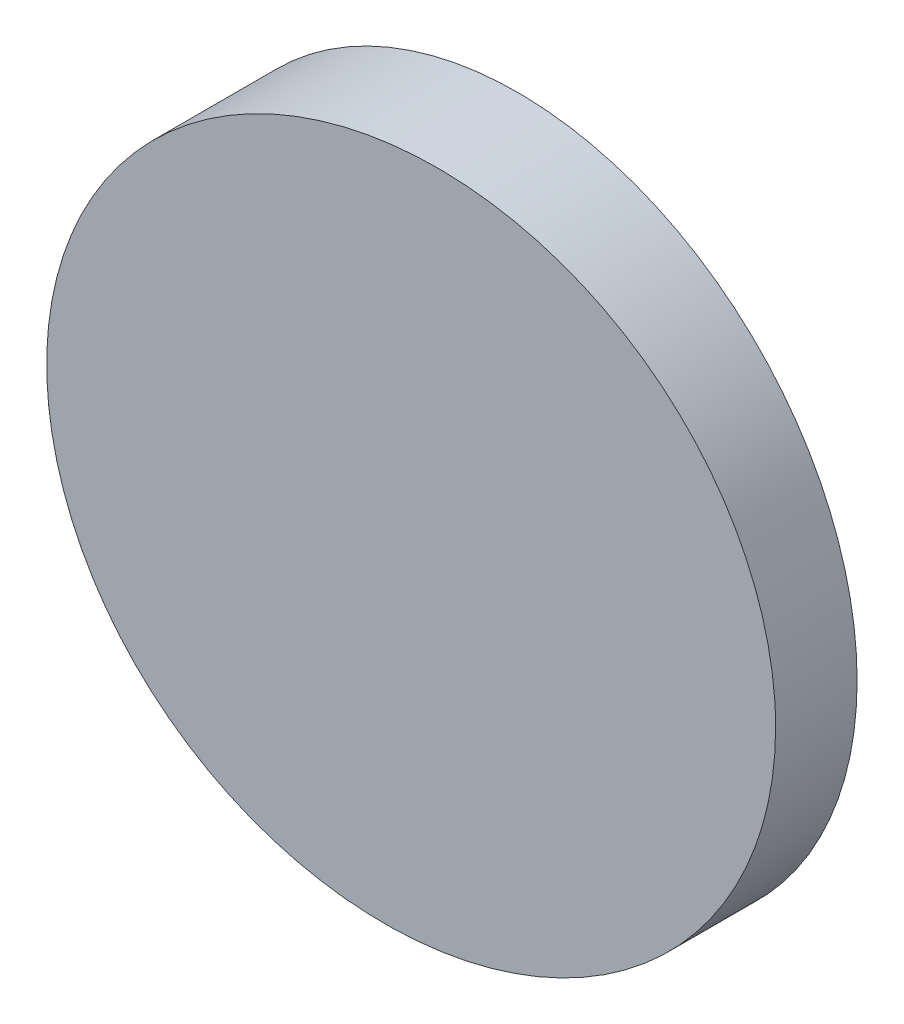
ISO-10303-21;
HEADER;
FILE_DESCRIPTION(('STEP AP214'),'2;1');
FILE_NAME('part.step','',(''),(''),'','','');
FILE_SCHEMA(('AUTOMOTIVE_DESIGN { 1 0 10303 214 1 1 1 1 }'));
ENDSEC;
DATA;
#1=APPLICATION_CONTEXT('core data for automotive mechanical design processes');
#2=APPLICATION_PROTOCOL_DEFINITION('international standard','automotive_design',2000,#1);
#3=PRODUCT_CONTEXT('',#1,'mechanical');
#4=PRODUCT('Part','Part','',(#3));
#5=PRODUCT_RELATED_PRODUCT_CATEGORY('part','',(#4));
#6=PRODUCT_DEFINITION_FORMATION('','',#4);
#7=PRODUCT_DEFINITION_CONTEXT('part definition',#1,'design');
#8=PRODUCT_DEFINITION('design','',#6,#7);
#9=PRODUCT_DEFINITION_SHAPE('','',#8);
#10=(LENGTH_UNIT() NAMED_UNIT(*) SI_UNIT(.MILLI.,.METRE.));
#11=(NAMED_UNIT(*) PLANE_ANGLE_UNIT() SI_UNIT($,.RADIAN.));
#12=(NAMED_UNIT(*) SI_UNIT($,.STERADIAN.) SOLID_ANGLE_UNIT());
#13=UNCERTAINTY_MEASURE_WITH_UNIT(LENGTH_MEASURE(1.E-05),#10,'distance_accuracy_value','');
#14=(GEOMETRIC_REPRESENTATION_CONTEXT(3) GLOBAL_UNCERTAINTY_ASSIGNED_CONTEXT((#13)) GLOBAL_UNIT_ASSIGNED_CONTEXT((#10,
#11,#12)) REPRESENTATION_CONTEXT('',''));
#15=CARTESIAN_POINT('',(0.,0.,0.));
#16=DIRECTION('',(0.,0.,1.));
#17=DIRECTION('',(1.,0.,0.));
#18=AXIS2_PLACEMENT_3D('',#15,#16,#17);
#19=CARTESIAN_POINT('',(0.,0.,10.));
#20=DIRECTION('',(0.,0.,-1.));
#21=DIRECTION('',(-1.,0.,0.));
#22=AXIS2_PLACEMENT_3D('',#19,#20,#21);
#23=CYLINDRICAL_SURFACE('',#22,12.5);
#24=CARTESIAN_POINT('',(0.,0.,3.91509121260579));
#25=DIRECTION('',(-0.0730119117674396,0.,-0.997331068773085));
#26=DIRECTION('',(0.997331068773085,0.,-0.0730119117674396));
#27=AXIS2_PLACEMENT_3D('',#24,#25,#26);
#28=ELLIPSE('',#27,12.5334509185375,12.5);
#29=CARTESIAN_POINT('',(12.5,0.,3.));
#30=VERTEX_POINT('',#29);
#31=EDGE_CURVE('E40',#30,#30,#28,.T.);
#32=ORIENTED_EDGE('',*,*,#31,.T.);
#33=EDGE_LOOP('',(#32));
#34=FACE_BOUND('',#33,.T.);
#35=CARTESIAN_POINT('',(0.,0.,0.));
#36=DIRECTION('',(0.,0.,1.));
#37=DIRECTION('',(1.,0.,0.));
#38=AXIS2_PLACEMENT_3D('',#35,#36,#37);
#39=CIRCLE('',#38,12.5);
#40=CARTESIAN_POINT('',(12.5,0.,0.));
#41=VERTEX_POINT('',#40);
#42=EDGE_CURVE('E10',#41,#41,#39,.T.);
#43=ORIENTED_EDGE('',*,*,#42,.T.);
#44=EDGE_LOOP('',(#43));
#45=FACE_BOUND('',#44,.T.);
#46=ADVANCED_FACE('F37',(#34,#45),#23,.T.);
#47=CARTESIAN_POINT('',(0.,0.,0.));
#48=DIRECTION('',(0.,0.,1.));
#49=DIRECTION('',(1.,0.,0.));
#50=AXIS2_PLACEMENT_3D('',#47,#48,#49);
#51=PLANE('',#50);
#52=ORIENTED_EDGE('',*,*,#42,.F.);
#53=EDGE_LOOP('',(#52));
#54=FACE_BOUND('',#53,.T.);
#55=ADVANCED_FACE('F54',(#54),#51,.F.);
#56=CARTESIAN_POINT('',(12.5,-25.,3.));
#57=DIRECTION('',(-0.0730119117674396,0.,-0.997331068773085));
#58=DIRECTION('',(-0.997331068773085,0.,0.0730119117674396));
#59=AXIS2_PLACEMENT_3D('',#56,#57,#58);
#60=PLANE('',#59);
#61=ORIENTED_EDGE('',*,*,#31,.F.);
#62=EDGE_LOOP('',(#61));
#63=FACE_BOUND('',#62,.T.);
#64=ADVANCED_FACE('F52',(#63),#60,.F.);
#65=CLOSED_SHELL('',(#46,#55,#64));
#66=MANIFOLD_SOLID_BREP('B2',#65);
#67=ADVANCED_BREP_SHAPE_REPRESENTATION('',(#18,#66),#14);
#68=SHAPE_DEFINITION_REPRESENTATION(#9,#67);
ENDSEC;
END-ISO-10303-21;
